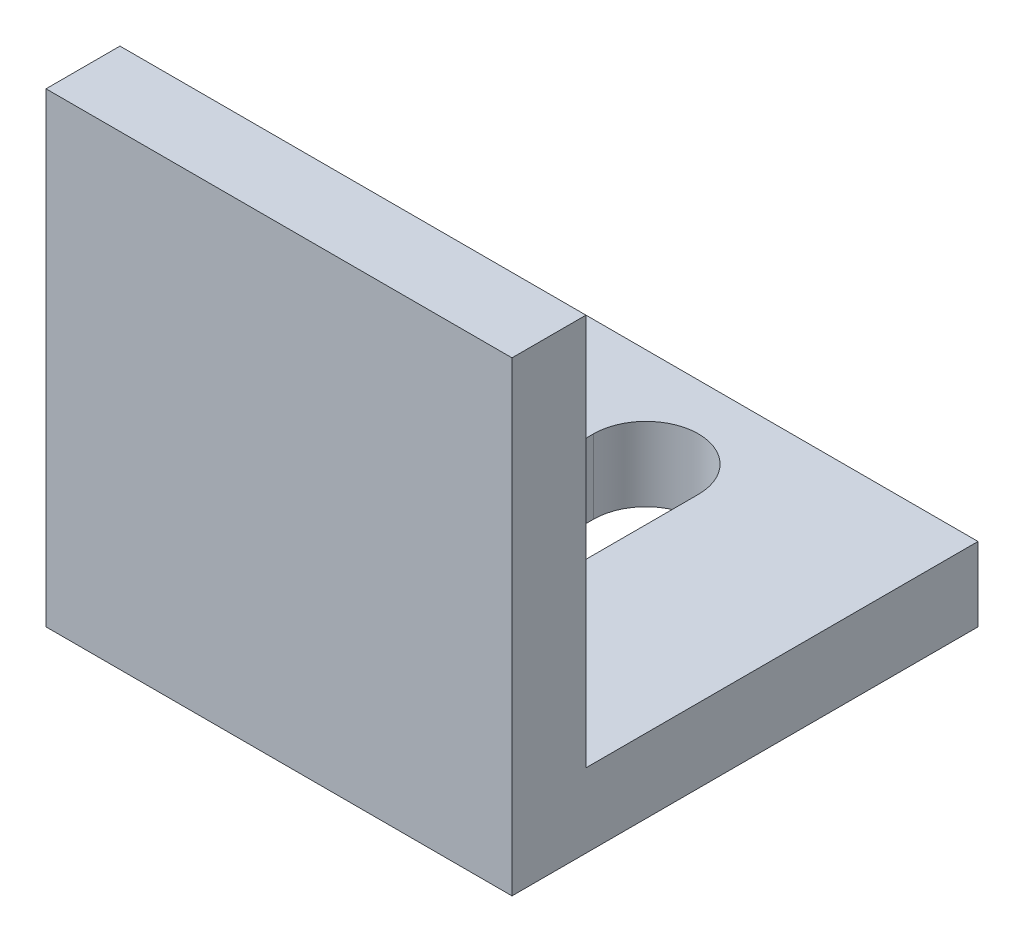
ISO-10303-21;
HEADER;
FILE_DESCRIPTION(('STEP AP214'),'2;1');
FILE_NAME('part.step','',(''),(''),'','','');
FILE_SCHEMA(('AUTOMOTIVE_DESIGN { 1 0 10303 214 1 1 1 1 }'));
ENDSEC;
DATA;
#1=APPLICATION_CONTEXT('core data for automotive mechanical design processes');
#2=APPLICATION_PROTOCOL_DEFINITION('international standard','automotive_design',2000,#1);
#3=PRODUCT_CONTEXT('',#1,'mechanical');
#4=PRODUCT('Part','Part','',(#3));
#5=PRODUCT_RELATED_PRODUCT_CATEGORY('part','',(#4));
#6=PRODUCT_DEFINITION_FORMATION('','',#4);
#7=PRODUCT_DEFINITION_CONTEXT('part definition',#1,'design');
#8=PRODUCT_DEFINITION('design','',#6,#7);
#9=PRODUCT_DEFINITION_SHAPE('','',#8);
#10=(LENGTH_UNIT() NAMED_UNIT(*) SI_UNIT(.MILLI.,.METRE.));
#11=(NAMED_UNIT(*) PLANE_ANGLE_UNIT() SI_UNIT($,.RADIAN.));
#12=(NAMED_UNIT(*) SI_UNIT($,.STERADIAN.) SOLID_ANGLE_UNIT());
#13=UNCERTAINTY_MEASURE_WITH_UNIT(LENGTH_MEASURE(1.E-05),#10,'distance_accuracy_value','');
#14=(GEOMETRIC_REPRESENTATION_CONTEXT(3) GLOBAL_UNCERTAINTY_ASSIGNED_CONTEXT((#13)) GLOBAL_UNIT_ASSIGNED_CONTEXT((#10,
#11,#12)) REPRESENTATION_CONTEXT('',''));
#15=CARTESIAN_POINT('',(0.,0.,0.));
#16=DIRECTION('',(0.,0.,1.));
#17=DIRECTION('',(1.,0.,0.));
#18=AXIS2_PLACEMENT_3D('',#15,#16,#17);
#19=CARTESIAN_POINT('',(20.,0.,0.));
#20=DIRECTION('',(0.,1.,0.));
#21=DIRECTION('',(0.,0.,1.));
#22=AXIS2_PLACEMENT_3D('',#19,#20,#21);
#23=PLANE('',#22);
#24=DIRECTION('',(0.,0.,1.));
#25=VECTOR('',#24,1.);
#26=CARTESIAN_POINT('',(12.25,0.,-15.75));
#27=LINE('',#26,#25);
#28=CARTESIAN_POINT('',(12.25,0.,-15.75));
#29=VERTEX_POINT('',#28);
#30=CARTESIAN_POINT('',(12.25,0.,-5.75));
#31=VERTEX_POINT('',#30);
#32=EDGE_CURVE('E129',#29,#31,#27,.T.);
#33=ORIENTED_EDGE('',*,*,#32,.F.);
#34=CARTESIAN_POINT('',(10.,0.,-15.75));
#35=DIRECTION('',(0.,-1.,0.));
#36=DIRECTION('',(0.,0.,1.));
#37=AXIS2_PLACEMENT_3D('',#34,#35,#36);
#38=CIRCLE('',#37,2.25);
#39=CARTESIAN_POINT('',(7.75000000000004,0.,-15.75));
#40=VERTEX_POINT('',#39);
#41=EDGE_CURVE('E54',#40,#29,#38,.T.);
#42=ORIENTED_EDGE('',*,*,#41,.F.);
#43=DIRECTION('',(0.,0.,-1.));
#44=VECTOR('',#43,1.);
#45=CARTESIAN_POINT('',(7.75000000000004,0.,-15.75));
#46=LINE('',#45,#44);
#47=CARTESIAN_POINT('',(7.75000000000004,0.,-5.75));
#48=VERTEX_POINT('',#47);
#49=EDGE_CURVE('E136',#48,#40,#46,.T.);
#50=ORIENTED_EDGE('',*,*,#49,.F.);
#51=CARTESIAN_POINT('',(10.,0.,-5.75));
#52=DIRECTION('',(0.,-1.,0.));
#53=DIRECTION('',(0.,0.,-1.));
#54=AXIS2_PLACEMENT_3D('',#51,#52,#53);
#55=CIRCLE('',#54,2.25);
#56=EDGE_CURVE('E119',#31,#48,#55,.T.);
#57=ORIENTED_EDGE('',*,*,#56,.F.);
#58=EDGE_LOOP('',(#33,#42,#50,#57));
#59=FACE_BOUND('',#58,.T.);
#60=DIRECTION('',(0.,0.,-1.));
#61=VECTOR('',#60,1.);
#62=CARTESIAN_POINT('',(0.,0.,0.));
#63=LINE('',#62,#61);
#64=CARTESIAN_POINT('',(0.,0.,0.));
#65=VERTEX_POINT('',#64);
#66=CARTESIAN_POINT('',(0.,0.,-20.));
#67=VERTEX_POINT('',#66);
#68=EDGE_CURVE('E146',#65,#67,#63,.T.);
#69=ORIENTED_EDGE('',*,*,#68,.T.);
#70=DIRECTION('',(-1.,0.,0.));
#71=VECTOR('',#70,1.);
#72=CARTESIAN_POINT('',(20.,0.,-20.));
#73=LINE('',#72,#71);
#74=CARTESIAN_POINT('',(20.,0.,-20.));
#75=VERTEX_POINT('',#74);
#76=EDGE_CURVE('E208',#75,#67,#73,.T.);
#77=ORIENTED_EDGE('',*,*,#76,.F.);
#78=DIRECTION('',(0.,0.,-1.));
#79=VECTOR('',#78,1.);
#80=CARTESIAN_POINT('',(20.,0.,0.));
#81=LINE('',#80,#79);
#82=CARTESIAN_POINT('',(20.,0.,0.));
#83=VERTEX_POINT('',#82);
#84=EDGE_CURVE('E151',#83,#75,#81,.T.);
#85=ORIENTED_EDGE('',*,*,#84,.F.);
#86=DIRECTION('',(-1.,0.,0.));
#87=VECTOR('',#86,1.);
#88=CARTESIAN_POINT('',(20.,0.,0.));
#89=LINE('',#88,#87);
#90=EDGE_CURVE('E171',#83,#65,#89,.T.);
#91=ORIENTED_EDGE('',*,*,#90,.T.);
#92=EDGE_LOOP('',(#69,#77,#85,#91));
#93=FACE_BOUND('',#92,.T.);
#94=ADVANCED_FACE('F39',(#59,#93),#23,.F.);
#95=CARTESIAN_POINT('',(20.,3.175,-20.));
#96=DIRECTION('',(0.,0.,1.));
#97=DIRECTION('',(1.,0.,0.));
#98=AXIS2_PLACEMENT_3D('',#95,#96,#97);
#99=PLANE('',#98);
#100=DIRECTION('',(0.,1.,0.));
#101=VECTOR('',#100,1.);
#102=CARTESIAN_POINT('',(0.,3.175,-20.));
#103=LINE('',#102,#101);
#104=CARTESIAN_POINT('',(0.,3.175,-20.));
#105=VERTEX_POINT('',#104);
#106=EDGE_CURVE('E175',#67,#105,#103,.T.);
#107=ORIENTED_EDGE('',*,*,#106,.T.);
#108=DIRECTION('',(-1.,0.,0.));
#109=VECTOR('',#108,1.);
#110=CARTESIAN_POINT('',(20.,3.175,-20.));
#111=LINE('',#110,#109);
#112=CARTESIAN_POINT('',(20.,3.175,-20.));
#113=VERTEX_POINT('',#112);
#114=EDGE_CURVE('E204',#113,#105,#111,.T.);
#115=ORIENTED_EDGE('',*,*,#114,.F.);
#116=DIRECTION('',(0.,1.,0.));
#117=VECTOR('',#116,1.);
#118=CARTESIAN_POINT('',(20.,3.175,-20.));
#119=LINE('',#118,#117);
#120=EDGE_CURVE('E155',#75,#113,#119,.T.);
#121=ORIENTED_EDGE('',*,*,#120,.F.);
#122=ORIENTED_EDGE('',*,*,#76,.T.);
#123=EDGE_LOOP('',(#107,#115,#121,#122));
#124=FACE_BOUND('',#123,.T.);
#125=ADVANCED_FACE('F239',(#124),#99,.F.);
#126=CARTESIAN_POINT('',(20.,3.175,-3.175));
#127=DIRECTION('',(0.,-1.,0.));
#128=DIRECTION('',(0.,0.,-1.));
#129=AXIS2_PLACEMENT_3D('',#126,#127,#128);
#130=PLANE('',#129);
#131=DIRECTION('',(0.,0.,-1.));
#132=VECTOR('',#131,1.);
#133=CARTESIAN_POINT('',(7.75000000000004,3.175,-3.17500000000001));
#134=LINE('',#133,#132);
#135=CARTESIAN_POINT('',(7.75000000000004,3.175,-5.75));
#136=VERTEX_POINT('',#135);
#137=CARTESIAN_POINT('',(7.75000000000004,3.175,-15.75));
#138=VERTEX_POINT('',#137);
#139=EDGE_CURVE('E47',#136,#138,#134,.T.);
#140=ORIENTED_EDGE('',*,*,#139,.T.);
#141=CARTESIAN_POINT('',(10.,3.175,-15.75));
#142=DIRECTION('',(0.,-1.,0.));
#143=DIRECTION('',(0.,0.,-1.));
#144=AXIS2_PLACEMENT_3D('',#141,#142,#143);
#145=CIRCLE('',#144,2.25);
#146=CARTESIAN_POINT('',(12.25,3.175,-15.75));
#147=VERTEX_POINT('',#146);
#148=EDGE_CURVE('E11',#138,#147,#145,.T.);
#149=ORIENTED_EDGE('',*,*,#148,.T.);
#150=DIRECTION('',(0.,0.,1.));
#151=VECTOR('',#150,1.);
#152=CARTESIAN_POINT('',(12.25,3.175,-3.175));
#153=LINE('',#152,#151);
#154=CARTESIAN_POINT('',(12.25,3.175,-5.75));
#155=VERTEX_POINT('',#154);
#156=EDGE_CURVE('E212',#147,#155,#153,.T.);
#157=ORIENTED_EDGE('',*,*,#156,.T.);
#158=CARTESIAN_POINT('',(10.,3.175,-5.75));
#159=DIRECTION('',(0.,-1.,0.));
#160=DIRECTION('',(0.,0.,-1.));
#161=AXIS2_PLACEMENT_3D('',#158,#159,#160);
#162=CIRCLE('',#161,2.25);
#163=EDGE_CURVE('E122',#155,#136,#162,.T.);
#164=ORIENTED_EDGE('',*,*,#163,.T.);
#165=EDGE_LOOP('',(#140,#149,#157,#164));
#166=FACE_BOUND('',#165,.T.);
#167=DIRECTION('',(0.,0.,1.));
#168=VECTOR('',#167,1.);
#169=CARTESIAN_POINT('',(0.,3.175,-3.175));
#170=LINE('',#169,#168);
#171=CARTESIAN_POINT('',(0.,3.175,-3.175));
#172=VERTEX_POINT('',#171);
#173=EDGE_CURVE('E178',#105,#172,#170,.T.);
#174=ORIENTED_EDGE('',*,*,#173,.T.);
#175=DIRECTION('',(-1.,0.,0.));
#176=VECTOR('',#175,1.);
#177=CARTESIAN_POINT('',(20.,3.175,-3.175));
#178=LINE('',#177,#176);
#179=CARTESIAN_POINT('',(20.,3.175,-3.175));
#180=VERTEX_POINT('',#179);
#181=EDGE_CURVE('E200',#180,#172,#178,.T.);
#182=ORIENTED_EDGE('',*,*,#181,.F.);
#183=DIRECTION('',(0.,0.,1.));
#184=VECTOR('',#183,1.);
#185=CARTESIAN_POINT('',(20.,3.175,-3.175));
#186=LINE('',#185,#184);
#187=EDGE_CURVE('E159',#113,#180,#186,.T.);
#188=ORIENTED_EDGE('',*,*,#187,.F.);
#189=ORIENTED_EDGE('',*,*,#114,.T.);
#190=EDGE_LOOP('',(#174,#182,#188,#189));
#191=FACE_BOUND('',#190,.T.);
#192=ADVANCED_FACE('F219',(#166,#191),#130,.F.);
#193=CARTESIAN_POINT('',(20.,20.,-3.175));
#194=DIRECTION('',(0.,0.,1.));
#195=DIRECTION('',(0.,-1.,0.));
#196=AXIS2_PLACEMENT_3D('',#193,#194,#195);
#197=PLANE('',#196);
#198=DIRECTION('',(0.,1.,0.));
#199=VECTOR('',#198,1.);
#200=CARTESIAN_POINT('',(0.,20.,-3.175));
#201=LINE('',#200,#199);
#202=CARTESIAN_POINT('',(0.,20.,-3.175));
#203=VERTEX_POINT('',#202);
#204=EDGE_CURVE('E181',#172,#203,#201,.T.);
#205=ORIENTED_EDGE('',*,*,#204,.T.);
#206=DIRECTION('',(-1.,0.,0.));
#207=VECTOR('',#206,1.);
#208=CARTESIAN_POINT('',(20.,20.,-3.175));
#209=LINE('',#208,#207);
#210=CARTESIAN_POINT('',(20.,20.,-3.175));
#211=VERTEX_POINT('',#210);
#212=EDGE_CURVE('E196',#211,#203,#209,.T.);
#213=ORIENTED_EDGE('',*,*,#212,.F.);
#214=DIRECTION('',(0.,1.,0.));
#215=VECTOR('',#214,1.);
#216=CARTESIAN_POINT('',(20.,20.,-3.175));
#217=LINE('',#216,#215);
#218=EDGE_CURVE('E162',#180,#211,#217,.T.);
#219=ORIENTED_EDGE('',*,*,#218,.F.);
#220=ORIENTED_EDGE('',*,*,#181,.T.);
#221=EDGE_LOOP('',(#205,#213,#219,#220));
#222=FACE_BOUND('',#221,.T.);
#223=ADVANCED_FACE('F247',(#222),#197,.F.);
#224=CARTESIAN_POINT('',(20.,20.,0.));
#225=DIRECTION('',(0.,-1.,0.));
#226=DIRECTION('',(0.,0.,-1.));
#227=AXIS2_PLACEMENT_3D('',#224,#225,#226);
#228=PLANE('',#227);
#229=DIRECTION('',(0.,0.,1.));
#230=VECTOR('',#229,1.);
#231=CARTESIAN_POINT('',(0.,20.,0.));
#232=LINE('',#231,#230);
#233=CARTESIAN_POINT('',(0.,20.,0.));
#234=VERTEX_POINT('',#233);
#235=EDGE_CURVE('E184',#203,#234,#232,.T.);
#236=ORIENTED_EDGE('',*,*,#235,.T.);
#237=DIRECTION('',(-1.,0.,0.));
#238=VECTOR('',#237,1.);
#239=CARTESIAN_POINT('',(20.,20.,0.));
#240=LINE('',#239,#238);
#241=CARTESIAN_POINT('',(20.,20.,0.));
#242=VERTEX_POINT('',#241);
#243=EDGE_CURVE('E192',#242,#234,#240,.T.);
#244=ORIENTED_EDGE('',*,*,#243,.F.);
#245=DIRECTION('',(0.,0.,1.));
#246=VECTOR('',#245,1.);
#247=CARTESIAN_POINT('',(20.,20.,0.));
#248=LINE('',#247,#246);
#249=EDGE_CURVE('E165',#211,#242,#248,.T.);
#250=ORIENTED_EDGE('',*,*,#249,.F.);
#251=ORIENTED_EDGE('',*,*,#212,.T.);
#252=EDGE_LOOP('',(#236,#244,#250,#251));
#253=FACE_BOUND('',#252,.T.);
#254=ADVANCED_FACE('F252',(#253),#228,.F.);
#255=CARTESIAN_POINT('',(20.,0.,0.));
#256=DIRECTION('',(0.,0.,-1.));
#257=DIRECTION('',(-1.,0.,0.));
#258=AXIS2_PLACEMENT_3D('',#255,#256,#257);
#259=PLANE('',#258);
#260=DIRECTION('',(0.,-1.,0.));
#261=VECTOR('',#260,1.);
#262=CARTESIAN_POINT('',(0.,0.,0.));
#263=LINE('',#262,#261);
#264=EDGE_CURVE('E156',#234,#65,#263,.T.);
#265=ORIENTED_EDGE('',*,*,#264,.T.);
#266=ORIENTED_EDGE('',*,*,#90,.F.);
#267=DIRECTION('',(0.,-1.,0.));
#268=VECTOR('',#267,1.);
#269=CARTESIAN_POINT('',(20.,0.,0.));
#270=LINE('',#269,#268);
#271=EDGE_CURVE('E168',#242,#83,#270,.T.);
#272=ORIENTED_EDGE('',*,*,#271,.F.);
#273=ORIENTED_EDGE('',*,*,#243,.T.);
#274=EDGE_LOOP('',(#265,#266,#272,#273));
#275=FACE_BOUND('',#274,.T.);
#276=ADVANCED_FACE('F256',(#275),#259,.F.);
#277=CARTESIAN_POINT('',(20.,0.,0.));
#278=DIRECTION('',(-1.,0.,0.));
#279=DIRECTION('',(0.,0.,1.));
#280=AXIS2_PLACEMENT_3D('',#277,#278,#279);
#281=PLANE('',#280);
#282=ORIENTED_EDGE('',*,*,#84,.T.);
#283=ORIENTED_EDGE('',*,*,#120,.T.);
#284=ORIENTED_EDGE('',*,*,#187,.T.);
#285=ORIENTED_EDGE('',*,*,#218,.T.);
#286=ORIENTED_EDGE('',*,*,#249,.T.);
#287=ORIENTED_EDGE('',*,*,#271,.T.);
#288=EDGE_LOOP('',(#282,#283,#284,#285,#286,#287));
#289=FACE_BOUND('',#288,.T.);
#290=ADVANCED_FACE('F233',(#289),#281,.F.);
#291=CARTESIAN_POINT('',(0.,0.,0.));
#292=DIRECTION('',(-1.,0.,0.));
#293=DIRECTION('',(0.,0.,1.));
#294=AXIS2_PLACEMENT_3D('',#291,#292,#293);
#295=PLANE('',#294);
#296=ORIENTED_EDGE('',*,*,#68,.F.);
#297=ORIENTED_EDGE('',*,*,#264,.F.);
#298=ORIENTED_EDGE('',*,*,#235,.F.);
#299=ORIENTED_EDGE('',*,*,#204,.F.);
#300=ORIENTED_EDGE('',*,*,#173,.F.);
#301=ORIENTED_EDGE('',*,*,#106,.F.);
#302=EDGE_LOOP('',(#296,#297,#298,#299,#300,#301));
#303=FACE_BOUND('',#302,.T.);
#304=ADVANCED_FACE('F226',(#303),#295,.T.);
#305=CARTESIAN_POINT('',(10.,20.,-15.75));
#306=DIRECTION('',(0.,-1.,0.));
#307=DIRECTION('',(0.,0.,-1.));
#308=AXIS2_PLACEMENT_3D('',#305,#306,#307);
#309=CYLINDRICAL_SURFACE('',#308,2.25);
#310=DIRECTION('',(0.,-1.,0.));
#311=VECTOR('',#310,1.);
#312=CARTESIAN_POINT('',(7.75000000000004,20.,-15.75));
#313=LINE('',#312,#311);
#314=EDGE_CURVE('E143',#138,#40,#313,.T.);
#315=ORIENTED_EDGE('',*,*,#314,.T.);
#316=ORIENTED_EDGE('',*,*,#41,.T.);
#317=DIRECTION('',(0.,-1.,0.));
#318=VECTOR('',#317,1.);
#319=CARTESIAN_POINT('',(12.25,20.,-15.75));
#320=LINE('',#319,#318);
#321=EDGE_CURVE('E126',#147,#29,#320,.T.);
#322=ORIENTED_EDGE('',*,*,#321,.F.);
#323=ORIENTED_EDGE('',*,*,#148,.F.);
#324=EDGE_LOOP('',(#315,#316,#322,#323));
#325=FACE_BOUND('',#324,.T.);
#326=ADVANCED_FACE('F224',(#325),#309,.F.);
#327=CARTESIAN_POINT('',(7.75000000000004,20.,-15.75));
#328=DIRECTION('',(-1.,0.,0.));
#329=DIRECTION('',(0.,0.,1.));
#330=AXIS2_PLACEMENT_3D('',#327,#328,#329);
#331=PLANE('',#330);
#332=DIRECTION('',(0.,-1.,0.));
#333=VECTOR('',#332,1.);
#334=CARTESIAN_POINT('',(7.75000000000004,20.,-5.75));
#335=LINE('',#334,#333);
#336=EDGE_CURVE('E125',#136,#48,#335,.T.);
#337=ORIENTED_EDGE('',*,*,#336,.T.);
#338=ORIENTED_EDGE('',*,*,#49,.T.);
#339=ORIENTED_EDGE('',*,*,#314,.F.);
#340=ORIENTED_EDGE('',*,*,#139,.F.);
#341=EDGE_LOOP('',(#337,#338,#339,#340));
#342=FACE_BOUND('',#341,.T.);
#343=ADVANCED_FACE('F223',(#342),#331,.F.);
#344=CARTESIAN_POINT('',(10.,20.,-5.75));
#345=DIRECTION('',(0.,-1.,0.));
#346=DIRECTION('',(0.,0.,-1.));
#347=AXIS2_PLACEMENT_3D('',#344,#345,#346);
#348=CYLINDRICAL_SURFACE('',#347,2.25);
#349=DIRECTION('',(0.,-1.,0.));
#350=VECTOR('',#349,1.);
#351=CARTESIAN_POINT('',(12.25,20.,-5.75));
#352=LINE('',#351,#350);
#353=EDGE_CURVE('E62',#155,#31,#352,.T.);
#354=ORIENTED_EDGE('',*,*,#353,.T.);
#355=ORIENTED_EDGE('',*,*,#56,.T.);
#356=ORIENTED_EDGE('',*,*,#336,.F.);
#357=ORIENTED_EDGE('',*,*,#163,.F.);
#358=EDGE_LOOP('',(#354,#355,#356,#357));
#359=FACE_BOUND('',#358,.T.);
#360=ADVANCED_FACE('F116',(#359),#348,.F.);
#361=CARTESIAN_POINT('',(12.25,20.,-15.75));
#362=DIRECTION('',(1.,0.,0.));
#363=DIRECTION('',(0.,0.,-1.));
#364=AXIS2_PLACEMENT_3D('',#361,#362,#363);
#365=PLANE('',#364);
#366=ORIENTED_EDGE('',*,*,#321,.T.);
#367=ORIENTED_EDGE('',*,*,#32,.T.);
#368=ORIENTED_EDGE('',*,*,#353,.F.);
#369=ORIENTED_EDGE('',*,*,#156,.F.);
#370=EDGE_LOOP('',(#366,#367,#368,#369));
#371=FACE_BOUND('',#370,.T.);
#372=ADVANCED_FACE('F130',(#371),#365,.F.);
#373=CLOSED_SHELL('',(#94,#125,#192,#223,#254,#276,#290,#304,#326,#343,#360,#372));
#374=MANIFOLD_SOLID_BREP('B2',#373);
#375=ADVANCED_BREP_SHAPE_REPRESENTATION('',(#18,#374),#14);
#376=SHAPE_DEFINITION_REPRESENTATION(#9,#375);
ENDSEC;
END-ISO-10303-21;
